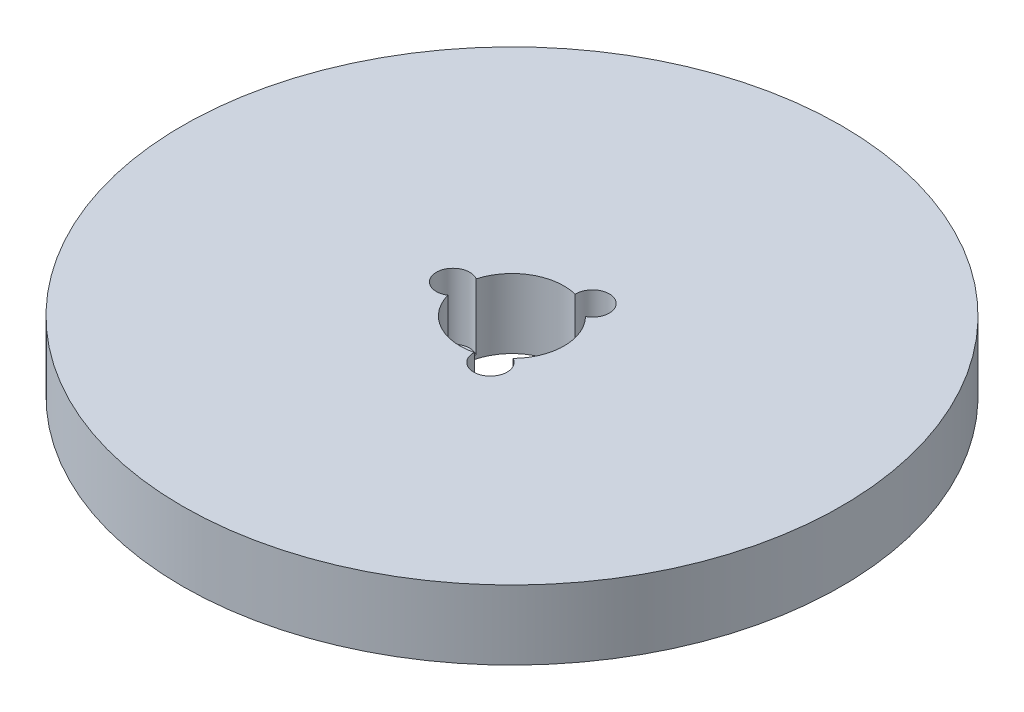
ISO-10303-21;
HEADER;
FILE_DESCRIPTION(('STEP AP214'),'2;1');
FILE_NAME('part.step','',(''),(''),'','','');
FILE_SCHEMA(('AUTOMOTIVE_DESIGN { 1 0 10303 214 1 1 1 1 }'));
ENDSEC;
DATA;
#1=APPLICATION_CONTEXT('core data for automotive mechanical design processes');
#2=APPLICATION_PROTOCOL_DEFINITION('international standard','automotive_design',2000,#1);
#3=PRODUCT_CONTEXT('',#1,'mechanical');
#4=PRODUCT('Part','Part','',(#3));
#5=PRODUCT_RELATED_PRODUCT_CATEGORY('part','',(#4));
#6=PRODUCT_DEFINITION_FORMATION('','',#4);
#7=PRODUCT_DEFINITION_CONTEXT('part definition',#1,'design');
#8=PRODUCT_DEFINITION('design','',#6,#7);
#9=PRODUCT_DEFINITION_SHAPE('','',#8);
#10=(LENGTH_UNIT() NAMED_UNIT(*) SI_UNIT(.MILLI.,.METRE.));
#11=(NAMED_UNIT(*) PLANE_ANGLE_UNIT() SI_UNIT($,.RADIAN.));
#12=(NAMED_UNIT(*) SI_UNIT($,.STERADIAN.) SOLID_ANGLE_UNIT());
#13=UNCERTAINTY_MEASURE_WITH_UNIT(LENGTH_MEASURE(1.E-05),#10,'distance_accuracy_value','');
#14=(GEOMETRIC_REPRESENTATION_CONTEXT(3) GLOBAL_UNCERTAINTY_ASSIGNED_CONTEXT((#13)) GLOBAL_UNIT_ASSIGNED_CONTEXT((#10,
#11,#12)) REPRESENTATION_CONTEXT('',''));
#15=CARTESIAN_POINT('',(0.,0.,0.));
#16=DIRECTION('',(0.,0.,1.));
#17=DIRECTION('',(1.,0.,0.));
#18=AXIS2_PLACEMENT_3D('',#15,#16,#17);
#19=CARTESIAN_POINT('',(0.,10.,0.));
#20=DIRECTION('',(0.,-1.,0.));
#21=DIRECTION('',(0.,0.,-1.));
#22=AXIS2_PLACEMENT_3D('',#19,#20,#21);
#23=CYLINDRICAL_SURFACE('',#22,47.5);
#24=CARTESIAN_POINT('',(0.,10.,0.));
#25=DIRECTION('',(0.,1.,0.));
#26=DIRECTION('',(0.,0.,1.));
#27=AXIS2_PLACEMENT_3D('',#24,#25,#26);
#28=CIRCLE('',#27,47.5);
#29=CARTESIAN_POINT('',(0.,10.,47.5));
#30=VERTEX_POINT('',#29);
#31=EDGE_CURVE('E126',#30,#30,#28,.T.);
#32=ORIENTED_EDGE('',*,*,#31,.F.);
#33=EDGE_LOOP('',(#32));
#34=FACE_BOUND('',#33,.T.);
#35=CARTESIAN_POINT('',(0.,0.,0.));
#36=DIRECTION('',(0.,1.,0.));
#37=DIRECTION('',(0.,0.,1.));
#38=AXIS2_PLACEMENT_3D('',#35,#36,#37);
#39=CIRCLE('',#38,47.5);
#40=CARTESIAN_POINT('',(0.,0.,47.5));
#41=VERTEX_POINT('',#40);
#42=EDGE_CURVE('E124',#41,#41,#39,.T.);
#43=ORIENTED_EDGE('',*,*,#42,.T.);
#44=EDGE_LOOP('',(#43));
#45=FACE_BOUND('',#44,.T.);
#46=ADVANCED_FACE('F39',(#34,#45),#23,.T.);
#47=CARTESIAN_POINT('',(0.,10.,0.));
#48=DIRECTION('',(0.,1.,0.));
#49=DIRECTION('',(0.,0.,1.));
#50=AXIS2_PLACEMENT_3D('',#47,#48,#49);
#51=PLANE('',#50);
#52=CARTESIAN_POINT('',(4.24936368352966,10.,7.36011379971133));
#53=DIRECTION('',(0.,1.,0.));
#54=DIRECTION('',(0.866025403784436,0.,-0.500000000000004));
#55=AXIS2_PLACEMENT_3D('',#52,#53,#54);
#56=CIRCLE('',#55,2.4130152765964);
#57=CARTESIAN_POINT('',(1.83798337381575,10.,7.27130092332705));
#58=VERTEX_POINT('',#57);
#59=CARTESIAN_POINT('',(5.37813963125465,10.,5.22739075512134));
#60=VERTEX_POINT('',#59);
#61=EDGE_CURVE('E147',#58,#60,#56,.T.);
#62=ORIENTED_EDGE('',*,*,#61,.F.);
#63=CARTESIAN_POINT('',(0.,10.,0.));
#64=DIRECTION('',(0.,1.,0.));
#65=DIRECTION('',(0.,0.,1.));
#66=AXIS2_PLACEMENT_3D('',#63,#64,#65);
#67=CIRCLE('',#66,7.5);
#68=CARTESIAN_POINT('',(-7.21612300507034,10.,2.0439101682057));
#69=VERTEX_POINT('',#68);
#70=EDGE_CURVE('E118',#69,#58,#67,.T.);
#71=ORIENTED_EDGE('',*,*,#70,.F.);
#72=CARTESIAN_POINT('',(-8.49872736705925,10.,0.));
#73=DIRECTION('',(0.,1.,0.));
#74=DIRECTION('',(0.,0.,1.));
#75=AXIS2_PLACEMENT_3D('',#72,#73,#74);
#76=CIRCLE('',#75,2.4130152765964);
#77=CARTESIAN_POINT('',(-7.21612300507034,10.,-2.0439101682057));
#78=VERTEX_POINT('',#77);
#79=EDGE_CURVE('E113',#78,#69,#76,.T.);
#80=ORIENTED_EDGE('',*,*,#79,.F.);
#81=CARTESIAN_POINT('',(1.83798337381564,10.,-7.27130092332708));
#82=VERTEX_POINT('',#81);
#83=EDGE_CURVE('E106',#82,#78,#67,.T.);
#84=ORIENTED_EDGE('',*,*,#83,.F.);
#85=CARTESIAN_POINT('',(4.24936368352956,10.,-7.36011379971139));
#86=DIRECTION('',(0.,1.,0.));
#87=DIRECTION('',(-0.866025403784443,0.,-0.499999999999992));
#88=AXIS2_PLACEMENT_3D('',#85,#86,#87);
#89=CIRCLE('',#88,2.4130152765964);
#90=CARTESIAN_POINT('',(5.37813963125458,10.,-5.22739075512142));
#91=VERTEX_POINT('',#90);
#92=EDGE_CURVE('E90',#91,#82,#89,.T.);
#93=ORIENTED_EDGE('',*,*,#92,.F.);
#94=EDGE_CURVE('E116',#60,#91,#67,.T.);
#95=ORIENTED_EDGE('',*,*,#94,.F.);
#96=EDGE_LOOP('',(#62,#71,#80,#84,#93,#95));
#97=FACE_BOUND('',#96,.T.);
#98=ORIENTED_EDGE('',*,*,#31,.T.);
#99=EDGE_LOOP('',(#98));
#100=FACE_BOUND('',#99,.T.);
#101=ADVANCED_FACE('F115',(#97,#100),#51,.T.);
#102=CARTESIAN_POINT('',(0.,0.,0.));
#103=DIRECTION('',(0.,1.,0.));
#104=DIRECTION('',(0.,0.,1.));
#105=AXIS2_PLACEMENT_3D('',#102,#103,#104);
#106=PLANE('',#105);
#107=CARTESIAN_POINT('',(0.,0.,0.));
#108=DIRECTION('',(0.,1.,0.));
#109=DIRECTION('',(0.,0.,1.));
#110=AXIS2_PLACEMENT_3D('',#107,#108,#109);
#111=CIRCLE('',#110,7.5);
#112=CARTESIAN_POINT('',(0.,0.,7.5));
#113=VERTEX_POINT('',#112);
#114=EDGE_CURVE('E120',#113,#113,#111,.T.);
#115=ORIENTED_EDGE('',*,*,#114,.T.);
#116=EDGE_LOOP('',(#115));
#117=FACE_BOUND('',#116,.T.);
#118=ORIENTED_EDGE('',*,*,#42,.F.);
#119=EDGE_LOOP('',(#118));
#120=FACE_BOUND('',#119,.T.);
#121=ADVANCED_FACE('F164',(#117,#120),#106,.F.);
#122=CARTESIAN_POINT('',(0.,10.,0.));
#123=DIRECTION('',(0.,-1.,0.));
#124=DIRECTION('',(0.,0.,-1.));
#125=AXIS2_PLACEMENT_3D('',#122,#123,#124);
#126=CYLINDRICAL_SURFACE('',#125,7.5);
#127=DIRECTION('',(0.,1.,0.));
#128=VECTOR('',#127,1.);
#129=CARTESIAN_POINT('',(1.83798337381575,5.25811258551356,7.27130092332705));
#130=LINE('',#129,#128);
#131=CARTESIAN_POINT('',(1.83798337381575,0.516225171027125,7.27130092332705));
#132=VERTEX_POINT('',#131);
#133=EDGE_CURVE('E11',#132,#58,#130,.T.);
#134=ORIENTED_EDGE('',*,*,#133,.F.);
#135=CARTESIAN_POINT('',(0.,0.516225171027125,0.));
#136=DIRECTION('',(0.,1.,0.));
#137=DIRECTION('',(0.,0.,1.));
#138=AXIS2_PLACEMENT_3D('',#135,#136,#137);
#139=CIRCLE('',#138,7.5);
#140=CARTESIAN_POINT('',(5.37813963125465,0.516225171027125,5.22739075512134));
#141=VERTEX_POINT('',#140);
#142=EDGE_CURVE('E144',#132,#141,#139,.T.);
#143=ORIENTED_EDGE('',*,*,#142,.T.);
#144=DIRECTION('',(0.,1.,0.));
#145=VECTOR('',#144,1.);
#146=CARTESIAN_POINT('',(5.37813963125465,5.25811258551356,5.22739075512134));
#147=LINE('',#146,#145);
#148=EDGE_CURVE('E46',#60,#141,#147,.F.);
#149=ORIENTED_EDGE('',*,*,#148,.F.);
#150=ORIENTED_EDGE('',*,*,#94,.T.);
#151=DIRECTION('',(0.,1.,0.));
#152=VECTOR('',#151,1.);
#153=CARTESIAN_POINT('',(5.37813963125458,5.25811258551356,-5.22739075512142));
#154=LINE('',#153,#152);
#155=CARTESIAN_POINT('',(5.37813963125458,0.516225171027125,-5.22739075512142));
#156=VERTEX_POINT('',#155);
#157=EDGE_CURVE('E92',#156,#91,#154,.T.);
#158=ORIENTED_EDGE('',*,*,#157,.F.);
#159=CARTESIAN_POINT('',(0.,0.516225171027125,0.));
#160=DIRECTION('',(0.,1.,0.));
#161=DIRECTION('',(0.,0.,1.));
#162=AXIS2_PLACEMENT_3D('',#159,#160,#161);
#163=CIRCLE('',#162,7.5);
#164=CARTESIAN_POINT('',(1.83798337381564,0.516225171027125,-7.27130092332708));
#165=VERTEX_POINT('',#164);
#166=EDGE_CURVE('E107',#156,#165,#163,.T.);
#167=ORIENTED_EDGE('',*,*,#166,.T.);
#168=DIRECTION('',(0.,1.,0.));
#169=VECTOR('',#168,1.);
#170=CARTESIAN_POINT('',(1.83798337381564,5.25811258551356,-7.27130092332708));
#171=LINE('',#170,#169);
#172=EDGE_CURVE('E95',#82,#165,#171,.F.);
#173=ORIENTED_EDGE('',*,*,#172,.F.);
#174=ORIENTED_EDGE('',*,*,#83,.T.);
#175=DIRECTION('',(0.,1.,0.));
#176=VECTOR('',#175,1.);
#177=CARTESIAN_POINT('',(-7.21612300507034,5.25811258551356,-2.0439101682057));
#178=LINE('',#177,#176);
#179=CARTESIAN_POINT('',(-7.21612300507034,0.516225171027125,-2.0439101682057));
#180=VERTEX_POINT('',#179);
#181=EDGE_CURVE('E143',#180,#78,#178,.T.);
#182=ORIENTED_EDGE('',*,*,#181,.F.);
#183=CARTESIAN_POINT('',(0.,0.516225171027125,0.));
#184=DIRECTION('',(0.,1.,0.));
#185=DIRECTION('',(0.,0.,1.));
#186=AXIS2_PLACEMENT_3D('',#183,#184,#185);
#187=CIRCLE('',#186,7.5);
#188=CARTESIAN_POINT('',(-7.21612300507034,0.516225171027125,2.0439101682057));
#189=VERTEX_POINT('',#188);
#190=EDGE_CURVE('E132',#180,#189,#187,.T.);
#191=ORIENTED_EDGE('',*,*,#190,.T.);
#192=DIRECTION('',(0.,1.,0.));
#193=VECTOR('',#192,1.);
#194=CARTESIAN_POINT('',(-7.21612300507034,5.25811258551356,2.0439101682057));
#195=LINE('',#194,#193);
#196=EDGE_CURVE('E137',#69,#189,#195,.F.);
#197=ORIENTED_EDGE('',*,*,#196,.F.);
#198=ORIENTED_EDGE('',*,*,#70,.T.);
#199=EDGE_LOOP('',(#134,#143,#149,#150,#158,#167,#173,#174,#182,#191,#197,#198));
#200=FACE_BOUND('',#199,.T.);
#201=ORIENTED_EDGE('',*,*,#114,.F.);
#202=EDGE_LOOP('',(#201));
#203=FACE_BOUND('',#202,.T.);
#204=ADVANCED_FACE('F103',(#200,#203),#126,.F.);
#205=CARTESIAN_POINT('',(-8.49872736705925,0.516225171027125,0.));
#206=DIRECTION('',(0.,1.,0.));
#207=DIRECTION('',(0.,0.,1.));
#208=AXIS2_PLACEMENT_3D('',#205,#206,#207);
#209=CYLINDRICAL_SURFACE('',#208,2.4130152765964);
#210=ORIENTED_EDGE('',*,*,#181,.T.);
#211=ORIENTED_EDGE('',*,*,#79,.T.);
#212=ORIENTED_EDGE('',*,*,#196,.T.);
#213=CARTESIAN_POINT('',(-8.49872736705925,0.516225171027125,0.));
#214=DIRECTION('',(0.,1.,0.));
#215=DIRECTION('',(0.,0.,1.));
#216=AXIS2_PLACEMENT_3D('',#213,#214,#215);
#217=CIRCLE('',#216,2.4130152765964);
#218=EDGE_CURVE('E121',#180,#189,#217,.T.);
#219=ORIENTED_EDGE('',*,*,#218,.F.);
#220=EDGE_LOOP('',(#210,#211,#212,#219));
#221=FACE_BOUND('',#220,.T.);
#222=ADVANCED_FACE('F174',(#221),#209,.F.);
#223=CARTESIAN_POINT('',(-8.49872736705925,0.516225171027125,0.));
#224=DIRECTION('',(0.,1.,0.));
#225=DIRECTION('',(0.,0.,1.));
#226=AXIS2_PLACEMENT_3D('',#223,#224,#225);
#227=PLANE('',#226);
#228=ORIENTED_EDGE('',*,*,#218,.T.);
#229=ORIENTED_EDGE('',*,*,#190,.F.);
#230=EDGE_LOOP('',(#228,#229));
#231=FACE_BOUND('',#230,.T.);
#232=ADVANCED_FACE('F177',(#231),#227,.T.);
#233=CARTESIAN_POINT('',(4.24936368352956,0.516225171027125,-7.36011379971139));
#234=DIRECTION('',(0.,1.,0.));
#235=DIRECTION('',(0.,0.,1.));
#236=AXIS2_PLACEMENT_3D('',#233,#234,#235);
#237=CYLINDRICAL_SURFACE('',#236,2.4130152765964);
#238=ORIENTED_EDGE('',*,*,#157,.T.);
#239=ORIENTED_EDGE('',*,*,#92,.T.);
#240=ORIENTED_EDGE('',*,*,#172,.T.);
#241=CARTESIAN_POINT('',(4.24936368352956,0.516225171027125,-7.36011379971139));
#242=DIRECTION('',(0.,1.,0.));
#243=DIRECTION('',(-0.866025403784443,0.,-0.499999999999992));
#244=AXIS2_PLACEMENT_3D('',#241,#242,#243);
#245=CIRCLE('',#244,2.4130152765964);
#246=EDGE_CURVE('E56',#156,#165,#245,.T.);
#247=ORIENTED_EDGE('',*,*,#246,.F.);
#248=EDGE_LOOP('',(#238,#239,#240,#247));
#249=FACE_BOUND('',#248,.T.);
#250=ADVANCED_FACE('F93',(#249),#237,.F.);
#251=CARTESIAN_POINT('',(4.24936368352956,0.516225171027125,-7.36011379971139));
#252=DIRECTION('',(0.,1.,0.));
#253=DIRECTION('',(-0.866025403784443,0.,-0.499999999999992));
#254=AXIS2_PLACEMENT_3D('',#251,#252,#253);
#255=PLANE('',#254);
#256=ORIENTED_EDGE('',*,*,#246,.T.);
#257=ORIENTED_EDGE('',*,*,#166,.F.);
#258=EDGE_LOOP('',(#256,#257));
#259=FACE_BOUND('',#258,.T.);
#260=ADVANCED_FACE('F160',(#259),#255,.T.);
#261=CARTESIAN_POINT('',(4.24936368352966,0.516225171027125,7.36011379971133));
#262=DIRECTION('',(0.,1.,0.));
#263=DIRECTION('',(0.,0.,1.));
#264=AXIS2_PLACEMENT_3D('',#261,#262,#263);
#265=CYLINDRICAL_SURFACE('',#264,2.4130152765964);
#266=ORIENTED_EDGE('',*,*,#133,.T.);
#267=ORIENTED_EDGE('',*,*,#61,.T.);
#268=ORIENTED_EDGE('',*,*,#148,.T.);
#269=CARTESIAN_POINT('',(4.24936368352966,0.516225171027125,7.36011379971133));
#270=DIRECTION('',(0.,1.,0.));
#271=DIRECTION('',(0.866025403784436,0.,-0.500000000000004));
#272=AXIS2_PLACEMENT_3D('',#269,#270,#271);
#273=CIRCLE('',#272,2.4130152765964);
#274=EDGE_CURVE('E55',#132,#141,#273,.T.);
#275=ORIENTED_EDGE('',*,*,#274,.F.);
#276=EDGE_LOOP('',(#266,#267,#268,#275));
#277=FACE_BOUND('',#276,.T.);
#278=ADVANCED_FACE('F149',(#277),#265,.F.);
#279=CARTESIAN_POINT('',(4.24936368352966,0.516225171027125,7.36011379971133));
#280=DIRECTION('',(0.,1.,0.));
#281=DIRECTION('',(0.866025403784436,0.,-0.500000000000004));
#282=AXIS2_PLACEMENT_3D('',#279,#280,#281);
#283=PLANE('',#282);
#284=ORIENTED_EDGE('',*,*,#274,.T.);
#285=ORIENTED_EDGE('',*,*,#142,.F.);
#286=EDGE_LOOP('',(#284,#285));
#287=FACE_BOUND('',#286,.T.);
#288=ADVANCED_FACE('F151',(#287),#283,.T.);
#289=CLOSED_SHELL('',(#46,#101,#121,#204,#222,#232,#250,#260,#278,#288));
#290=MANIFOLD_SOLID_BREP('B2',#289);
#291=ADVANCED_BREP_SHAPE_REPRESENTATION('',(#18,#290),#14);
#292=SHAPE_DEFINITION_REPRESENTATION(#9,#291);
ENDSEC;
END-ISO-10303-21;
